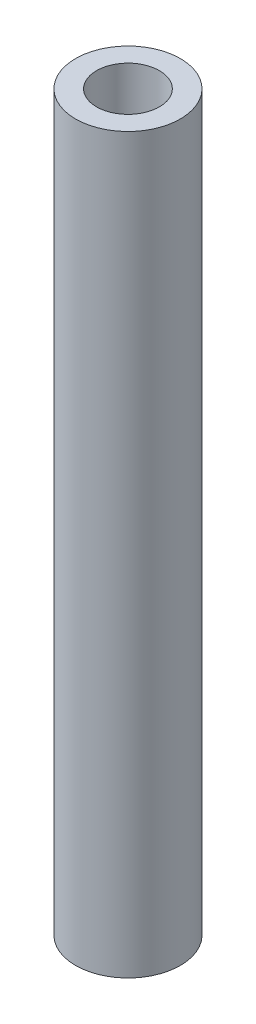
ISO-10303-21;
HEADER;
FILE_DESCRIPTION(('STEP AP214'),'2;1');
FILE_NAME('part.step','',(''),(''),'','','');
FILE_SCHEMA(('AUTOMOTIVE_DESIGN { 1 0 10303 214 1 1 1 1 }'));
ENDSEC;
DATA;
#1=APPLICATION_CONTEXT('core data for automotive mechanical design processes');
#2=APPLICATION_PROTOCOL_DEFINITION('international standard','automotive_design',2000,#1);
#3=PRODUCT_CONTEXT('',#1,'mechanical');
#4=PRODUCT('Part','Part','',(#3));
#5=PRODUCT_RELATED_PRODUCT_CATEGORY('part','',(#4));
#6=PRODUCT_DEFINITION_FORMATION('','',#4);
#7=PRODUCT_DEFINITION_CONTEXT('part definition',#1,'design');
#8=PRODUCT_DEFINITION('design','',#6,#7);
#9=PRODUCT_DEFINITION_SHAPE('','',#8);
#10=(LENGTH_UNIT() NAMED_UNIT(*) SI_UNIT(.MILLI.,.METRE.));
#11=(NAMED_UNIT(*) PLANE_ANGLE_UNIT() SI_UNIT($,.RADIAN.));
#12=(NAMED_UNIT(*) SI_UNIT($,.STERADIAN.) SOLID_ANGLE_UNIT());
#13=UNCERTAINTY_MEASURE_WITH_UNIT(LENGTH_MEASURE(1.E-05),#10,'distance_accuracy_value','');
#14=(GEOMETRIC_REPRESENTATION_CONTEXT(3) GLOBAL_UNCERTAINTY_ASSIGNED_CONTEXT((#13)) GLOBAL_UNIT_ASSIGNED_CONTEXT((#10,
#11,#12)) REPRESENTATION_CONTEXT('',''));
#15=CARTESIAN_POINT('',(0.,0.,0.));
#16=DIRECTION('',(0.,0.,1.));
#17=DIRECTION('',(1.,0.,0.));
#18=AXIS2_PLACEMENT_3D('',#15,#16,#17);
#19=CARTESIAN_POINT('',(0.,35.,0.));
#20=DIRECTION('',(0.,1.,0.));
#21=DIRECTION('',(0.,0.,1.));
#22=AXIS2_PLACEMENT_3D('',#19,#20,#21);
#23=PLANE('',#22);
#24=CARTESIAN_POINT('',(0.,35.,0.));
#25=DIRECTION('',(0.,1.,0.));
#26=DIRECTION('',(0.,0.,1.));
#27=AXIS2_PLACEMENT_3D('',#24,#25,#26);
#28=CIRCLE('',#27,2.5);
#29=CARTESIAN_POINT('',(0.,35.,2.5));
#30=VERTEX_POINT('',#29);
#31=EDGE_CURVE('E10',#30,#30,#28,.T.);
#32=ORIENTED_EDGE('',*,*,#31,.T.);
#33=EDGE_LOOP('',(#32));
#34=FACE_BOUND('',#33,.T.);
#35=CARTESIAN_POINT('',(0.,35.,0.));
#36=DIRECTION('',(0.,1.,0.));
#37=DIRECTION('',(0.,0.,1.));
#38=AXIS2_PLACEMENT_3D('',#35,#36,#37);
#39=CIRCLE('',#38,1.5);
#40=CARTESIAN_POINT('',(0.,35.,1.5));
#41=VERTEX_POINT('',#40);
#42=EDGE_CURVE('E44',#41,#41,#39,.T.);
#43=ORIENTED_EDGE('',*,*,#42,.F.);
#44=EDGE_LOOP('',(#43));
#45=FACE_BOUND('',#44,.T.);
#46=ADVANCED_FACE('F33',(#34,#45),#23,.T.);
#47=CARTESIAN_POINT('',(0.,0.,0.));
#48=DIRECTION('',(0.,1.,0.));
#49=DIRECTION('',(0.,0.,1.));
#50=AXIS2_PLACEMENT_3D('',#47,#48,#49);
#51=PLANE('',#50);
#52=CARTESIAN_POINT('',(0.,0.,0.));
#53=DIRECTION('',(0.,1.,0.));
#54=DIRECTION('',(0.,0.,1.));
#55=AXIS2_PLACEMENT_3D('',#52,#53,#54);
#56=CIRCLE('',#55,2.5);
#57=CARTESIAN_POINT('',(0.,0.,2.5));
#58=VERTEX_POINT('',#57);
#59=EDGE_CURVE('E37',#58,#58,#56,.T.);
#60=ORIENTED_EDGE('',*,*,#59,.F.);
#61=EDGE_LOOP('',(#60));
#62=FACE_BOUND('',#61,.T.);
#63=CARTESIAN_POINT('',(0.,0.,0.));
#64=DIRECTION('',(0.,1.,0.));
#65=DIRECTION('',(0.,0.,1.));
#66=AXIS2_PLACEMENT_3D('',#63,#64,#65);
#67=CIRCLE('',#66,1.5);
#68=CARTESIAN_POINT('',(0.,0.,1.5));
#69=VERTEX_POINT('',#68);
#70=EDGE_CURVE('E46',#69,#69,#67,.T.);
#71=ORIENTED_EDGE('',*,*,#70,.T.);
#72=EDGE_LOOP('',(#71));
#73=FACE_BOUND('',#72,.T.);
#74=ADVANCED_FACE('F56',(#62,#73),#51,.F.);
#75=CARTESIAN_POINT('',(0.,35.,0.));
#76=DIRECTION('',(0.,-1.,0.));
#77=DIRECTION('',(0.,0.,-1.));
#78=AXIS2_PLACEMENT_3D('',#75,#76,#77);
#79=CYLINDRICAL_SURFACE('',#78,2.5);
#80=ORIENTED_EDGE('',*,*,#31,.F.);
#81=EDGE_LOOP('',(#80));
#82=FACE_BOUND('',#81,.T.);
#83=ORIENTED_EDGE('',*,*,#59,.T.);
#84=EDGE_LOOP('',(#83));
#85=FACE_BOUND('',#84,.T.);
#86=ADVANCED_FACE('F35',(#82,#85),#79,.T.);
#87=CARTESIAN_POINT('',(0.,35.,0.));
#88=DIRECTION('',(0.,-1.,0.));
#89=DIRECTION('',(0.,0.,-1.));
#90=AXIS2_PLACEMENT_3D('',#87,#88,#89);
#91=CYLINDRICAL_SURFACE('',#90,1.5);
#92=ORIENTED_EDGE('',*,*,#42,.T.);
#93=EDGE_LOOP('',(#92));
#94=FACE_BOUND('',#93,.T.);
#95=ORIENTED_EDGE('',*,*,#70,.F.);
#96=EDGE_LOOP('',(#95));
#97=FACE_BOUND('',#96,.T.);
#98=ADVANCED_FACE('F52',(#94,#97),#91,.F.);
#99=CLOSED_SHELL('',(#46,#74,#86,#98));
#100=MANIFOLD_SOLID_BREP('B2',#99);
#101=ADVANCED_BREP_SHAPE_REPRESENTATION('',(#18,#100),#14);
#102=SHAPE_DEFINITION_REPRESENTATION(#9,#101);
ENDSEC;
END-ISO-10303-21;
